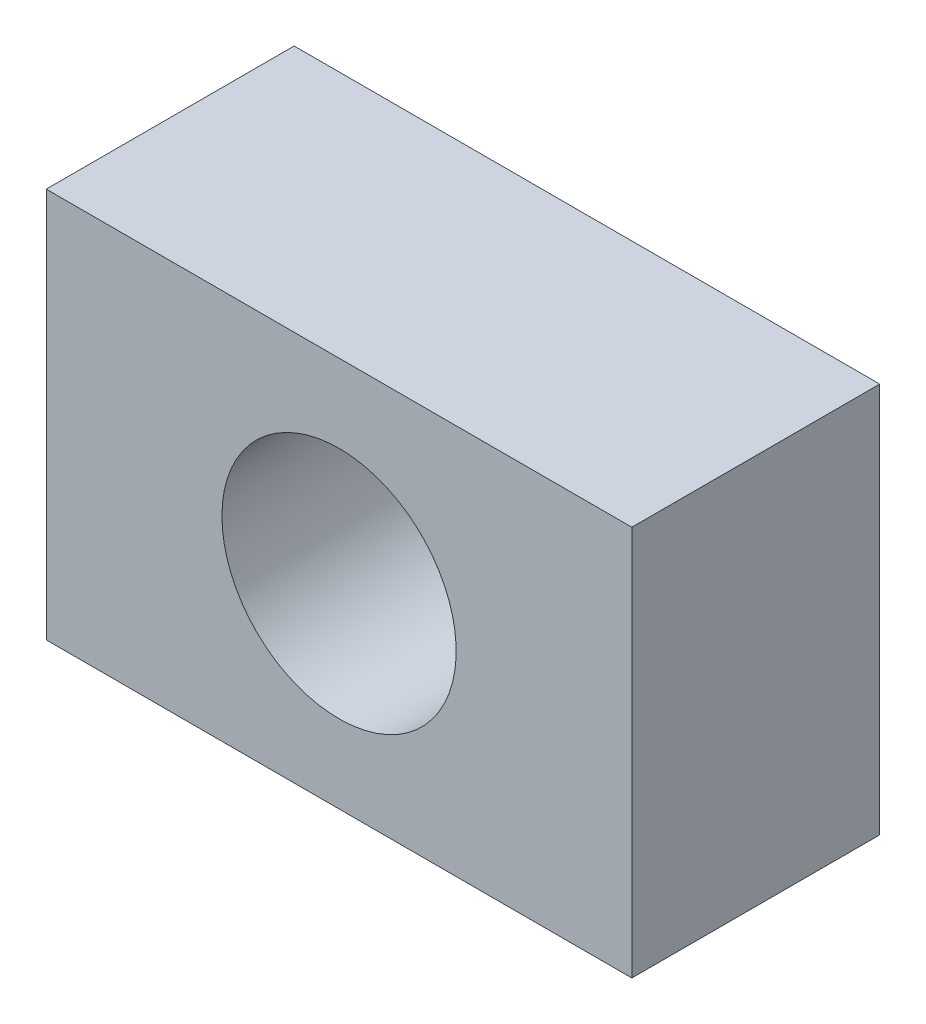
ISO-10303-21;
HEADER;
FILE_DESCRIPTION(('STEP AP214'),'2;1');
FILE_NAME('part.step','',(''),(''),'','','');
FILE_SCHEMA(('AUTOMOTIVE_DESIGN { 1 0 10303 214 1 1 1 1 }'));
ENDSEC;
DATA;
#1=APPLICATION_CONTEXT('core data for automotive mechanical design processes');
#2=APPLICATION_PROTOCOL_DEFINITION('international standard','automotive_design',2000,#1);
#3=PRODUCT_CONTEXT('',#1,'mechanical');
#4=PRODUCT('Part','Part','',(#3));
#5=PRODUCT_RELATED_PRODUCT_CATEGORY('part','',(#4));
#6=PRODUCT_DEFINITION_FORMATION('','',#4);
#7=PRODUCT_DEFINITION_CONTEXT('part definition',#1,'design');
#8=PRODUCT_DEFINITION('design','',#6,#7);
#9=PRODUCT_DEFINITION_SHAPE('','',#8);
#10=(LENGTH_UNIT() NAMED_UNIT(*) SI_UNIT(.MILLI.,.METRE.));
#11=(NAMED_UNIT(*) PLANE_ANGLE_UNIT() SI_UNIT($,.RADIAN.));
#12=(NAMED_UNIT(*) SI_UNIT($,.STERADIAN.) SOLID_ANGLE_UNIT());
#13=UNCERTAINTY_MEASURE_WITH_UNIT(LENGTH_MEASURE(1.E-05),#10,'distance_accuracy_value','');
#14=(GEOMETRIC_REPRESENTATION_CONTEXT(3) GLOBAL_UNCERTAINTY_ASSIGNED_CONTEXT((#13)) GLOBAL_UNIT_ASSIGNED_CONTEXT((#10,
#11,#12)) REPRESENTATION_CONTEXT('',''));
#15=CARTESIAN_POINT('',(0.,0.,0.));
#16=DIRECTION('',(0.,0.,1.));
#17=DIRECTION('',(1.,0.,0.));
#18=AXIS2_PLACEMENT_3D('',#15,#16,#17);
#19=CARTESIAN_POINT('',(7.5,-5.,6.35));
#20=DIRECTION('',(-1.,0.,0.));
#21=DIRECTION('',(0.,0.,1.));
#22=AXIS2_PLACEMENT_3D('',#19,#20,#21);
#23=PLANE('',#22);
#24=DIRECTION('',(0.,1.,0.));
#25=VECTOR('',#24,1.);
#26=CARTESIAN_POINT('',(7.5,-5.,0.));
#27=LINE('',#26,#25);
#28=CARTESIAN_POINT('',(7.5,-5.,0.));
#29=VERTEX_POINT('',#28);
#30=CARTESIAN_POINT('',(7.5,5.,0.));
#31=VERTEX_POINT('',#30);
#32=EDGE_CURVE('E107',#29,#31,#27,.T.);
#33=ORIENTED_EDGE('',*,*,#32,.T.);
#34=DIRECTION('',(0.,0.,-1.));
#35=VECTOR('',#34,1.);
#36=CARTESIAN_POINT('',(7.5,5.,6.35));
#37=LINE('',#36,#35);
#38=CARTESIAN_POINT('',(7.5,5.,6.35));
#39=VERTEX_POINT('',#38);
#40=EDGE_CURVE('E11',#39,#31,#37,.T.);
#41=ORIENTED_EDGE('',*,*,#40,.F.);
#42=DIRECTION('',(0.,1.,0.));
#43=VECTOR('',#42,1.);
#44=CARTESIAN_POINT('',(7.5,-5.,6.35));
#45=LINE('',#44,#43);
#46=CARTESIAN_POINT('',(7.5,-5.,6.35));
#47=VERTEX_POINT('',#46);
#48=EDGE_CURVE('E91',#47,#39,#45,.T.);
#49=ORIENTED_EDGE('',*,*,#48,.F.);
#50=DIRECTION('',(0.,0.,-1.));
#51=VECTOR('',#50,1.);
#52=CARTESIAN_POINT('',(7.5,-5.,6.35));
#53=LINE('',#52,#51);
#54=EDGE_CURVE('E103',#47,#29,#53,.T.);
#55=ORIENTED_EDGE('',*,*,#54,.T.);
#56=EDGE_LOOP('',(#33,#41,#49,#55));
#57=FACE_BOUND('',#56,.T.);
#58=ADVANCED_FACE('F39',(#57),#23,.F.);
#59=CARTESIAN_POINT('',(-7.5,5.,6.35));
#60=DIRECTION('',(0.,-1.,0.));
#61=DIRECTION('',(0.,0.,-1.));
#62=AXIS2_PLACEMENT_3D('',#59,#60,#61);
#63=PLANE('',#62);
#64=DIRECTION('',(-1.,0.,0.));
#65=VECTOR('',#64,1.);
#66=CARTESIAN_POINT('',(-7.5,5.,0.));
#67=LINE('',#66,#65);
#68=CARTESIAN_POINT('',(-7.5,5.,0.));
#69=VERTEX_POINT('',#68);
#70=EDGE_CURVE('E96',#31,#69,#67,.T.);
#71=ORIENTED_EDGE('',*,*,#70,.T.);
#72=DIRECTION('',(0.,0.,-1.));
#73=VECTOR('',#72,1.);
#74=CARTESIAN_POINT('',(-7.5,5.,6.35));
#75=LINE('',#74,#73);
#76=CARTESIAN_POINT('',(-7.5,5.,6.35));
#77=VERTEX_POINT('',#76);
#78=EDGE_CURVE('E48',#77,#69,#75,.T.);
#79=ORIENTED_EDGE('',*,*,#78,.F.);
#80=DIRECTION('',(-1.,0.,0.));
#81=VECTOR('',#80,1.);
#82=CARTESIAN_POINT('',(-7.5,5.,6.35));
#83=LINE('',#82,#81);
#84=EDGE_CURVE('E86',#39,#77,#83,.T.);
#85=ORIENTED_EDGE('',*,*,#84,.F.);
#86=ORIENTED_EDGE('',*,*,#40,.T.);
#87=EDGE_LOOP('',(#71,#79,#85,#86));
#88=FACE_BOUND('',#87,.T.);
#89=ADVANCED_FACE('F95',(#88),#63,.F.);
#90=CARTESIAN_POINT('',(-7.5,-5.,6.35));
#91=DIRECTION('',(1.,0.,0.));
#92=DIRECTION('',(0.,0.,-1.));
#93=AXIS2_PLACEMENT_3D('',#90,#91,#92);
#94=PLANE('',#93);
#95=DIRECTION('',(0.,-1.,0.));
#96=VECTOR('',#95,1.);
#97=CARTESIAN_POINT('',(-7.5,-5.,0.));
#98=LINE('',#97,#96);
#99=CARTESIAN_POINT('',(-7.5,-5.,0.));
#100=VERTEX_POINT('',#99);
#101=EDGE_CURVE('E73',#69,#100,#98,.T.);
#102=ORIENTED_EDGE('',*,*,#101,.T.);
#103=DIRECTION('',(0.,0.,-1.));
#104=VECTOR('',#103,1.);
#105=CARTESIAN_POINT('',(-7.5,-5.,6.35));
#106=LINE('',#105,#104);
#107=CARTESIAN_POINT('',(-7.5,-5.,6.35));
#108=VERTEX_POINT('',#107);
#109=EDGE_CURVE('E98',#108,#100,#106,.T.);
#110=ORIENTED_EDGE('',*,*,#109,.F.);
#111=DIRECTION('',(0.,-1.,0.));
#112=VECTOR('',#111,1.);
#113=CARTESIAN_POINT('',(-7.5,-5.,6.35));
#114=LINE('',#113,#112);
#115=EDGE_CURVE('E89',#77,#108,#114,.T.);
#116=ORIENTED_EDGE('',*,*,#115,.F.);
#117=ORIENTED_EDGE('',*,*,#78,.T.);
#118=EDGE_LOOP('',(#102,#110,#116,#117));
#119=FACE_BOUND('',#118,.T.);
#120=ADVANCED_FACE('F99',(#119),#94,.F.);
#121=CARTESIAN_POINT('',(-7.5,-5.,6.35));
#122=DIRECTION('',(0.,1.,0.));
#123=DIRECTION('',(0.,0.,1.));
#124=AXIS2_PLACEMENT_3D('',#121,#122,#123);
#125=PLANE('',#124);
#126=DIRECTION('',(1.,0.,0.));
#127=VECTOR('',#126,1.);
#128=CARTESIAN_POINT('',(-7.5,-5.,0.));
#129=LINE('',#128,#127);
#130=EDGE_CURVE('E79',#100,#29,#129,.T.);
#131=ORIENTED_EDGE('',*,*,#130,.T.);
#132=ORIENTED_EDGE('',*,*,#54,.F.);
#133=DIRECTION('',(1.,0.,0.));
#134=VECTOR('',#133,1.);
#135=CARTESIAN_POINT('',(-7.5,-5.,6.35));
#136=LINE('',#135,#134);
#137=EDGE_CURVE('E56',#108,#47,#136,.T.);
#138=ORIENTED_EDGE('',*,*,#137,.F.);
#139=ORIENTED_EDGE('',*,*,#109,.T.);
#140=EDGE_LOOP('',(#131,#132,#138,#139));
#141=FACE_BOUND('',#140,.T.);
#142=ADVANCED_FACE('F121',(#141),#125,.F.);
#143=CARTESIAN_POINT('',(0.,0.,6.35));
#144=DIRECTION('',(0.,0.,-1.));
#145=DIRECTION('',(-1.,0.,0.));
#146=AXIS2_PLACEMENT_3D('',#143,#144,#145);
#147=PLANE('',#146);
#148=CARTESIAN_POINT('',(0.,0.,6.35));
#149=DIRECTION('',(0.,0.,-1.));
#150=DIRECTION('',(-1.,0.,0.));
#151=AXIS2_PLACEMENT_3D('',#148,#149,#150);
#152=CIRCLE('',#151,3.);
#153=CARTESIAN_POINT('',(-3.,0.,6.35));
#154=VERTEX_POINT('',#153);
#155=EDGE_CURVE('E111',#154,#154,#152,.T.);
#156=ORIENTED_EDGE('',*,*,#155,.T.);
#157=EDGE_LOOP('',(#156));
#158=FACE_BOUND('',#157,.T.);
#159=ORIENTED_EDGE('',*,*,#48,.T.);
#160=ORIENTED_EDGE('',*,*,#84,.T.);
#161=ORIENTED_EDGE('',*,*,#115,.T.);
#162=ORIENTED_EDGE('',*,*,#137,.T.);
#163=EDGE_LOOP('',(#159,#160,#161,#162));
#164=FACE_BOUND('',#163,.T.);
#165=ADVANCED_FACE('F87',(#158,#164),#147,.F.);
#166=CARTESIAN_POINT('',(0.,0.,0.));
#167=DIRECTION('',(0.,0.,-1.));
#168=DIRECTION('',(-1.,0.,0.));
#169=AXIS2_PLACEMENT_3D('',#166,#167,#168);
#170=PLANE('',#169);
#171=CARTESIAN_POINT('',(0.,0.,0.));
#172=DIRECTION('',(0.,0.,-1.));
#173=DIRECTION('',(-1.,0.,0.));
#174=AXIS2_PLACEMENT_3D('',#171,#172,#173);
#175=CIRCLE('',#174,3.);
#176=CARTESIAN_POINT('',(-3.,0.,0.));
#177=VERTEX_POINT('',#176);
#178=EDGE_CURVE('E128',#177,#177,#175,.T.);
#179=ORIENTED_EDGE('',*,*,#178,.F.);
#180=EDGE_LOOP('',(#179));
#181=FACE_BOUND('',#180,.T.);
#182=ORIENTED_EDGE('',*,*,#32,.F.);
#183=ORIENTED_EDGE('',*,*,#130,.F.);
#184=ORIENTED_EDGE('',*,*,#101,.F.);
#185=ORIENTED_EDGE('',*,*,#70,.F.);
#186=EDGE_LOOP('',(#182,#183,#184,#185));
#187=FACE_BOUND('',#186,.T.);
#188=ADVANCED_FACE('F124',(#181,#187),#170,.T.);
#189=CARTESIAN_POINT('',(0.,0.,6.35));
#190=DIRECTION('',(0.,0.,-1.));
#191=DIRECTION('',(-1.,0.,0.));
#192=AXIS2_PLACEMENT_3D('',#189,#190,#191);
#193=CYLINDRICAL_SURFACE('',#192,3.);
#194=ORIENTED_EDGE('',*,*,#155,.F.);
#195=EDGE_LOOP('',(#194));
#196=FACE_BOUND('',#195,.T.);
#197=ORIENTED_EDGE('',*,*,#178,.T.);
#198=EDGE_LOOP('',(#197));
#199=FACE_BOUND('',#198,.T.);
#200=ADVANCED_FACE('F137',(#196,#199),#193,.F.);
#201=CLOSED_SHELL('',(#58,#89,#120,#142,#165,#188,#200));
#202=MANIFOLD_SOLID_BREP('B2',#201);
#203=ADVANCED_BREP_SHAPE_REPRESENTATION('',(#18,#202),#14);
#204=SHAPE_DEFINITION_REPRESENTATION(#9,#203);
ENDSEC;
END-ISO-10303-21;
